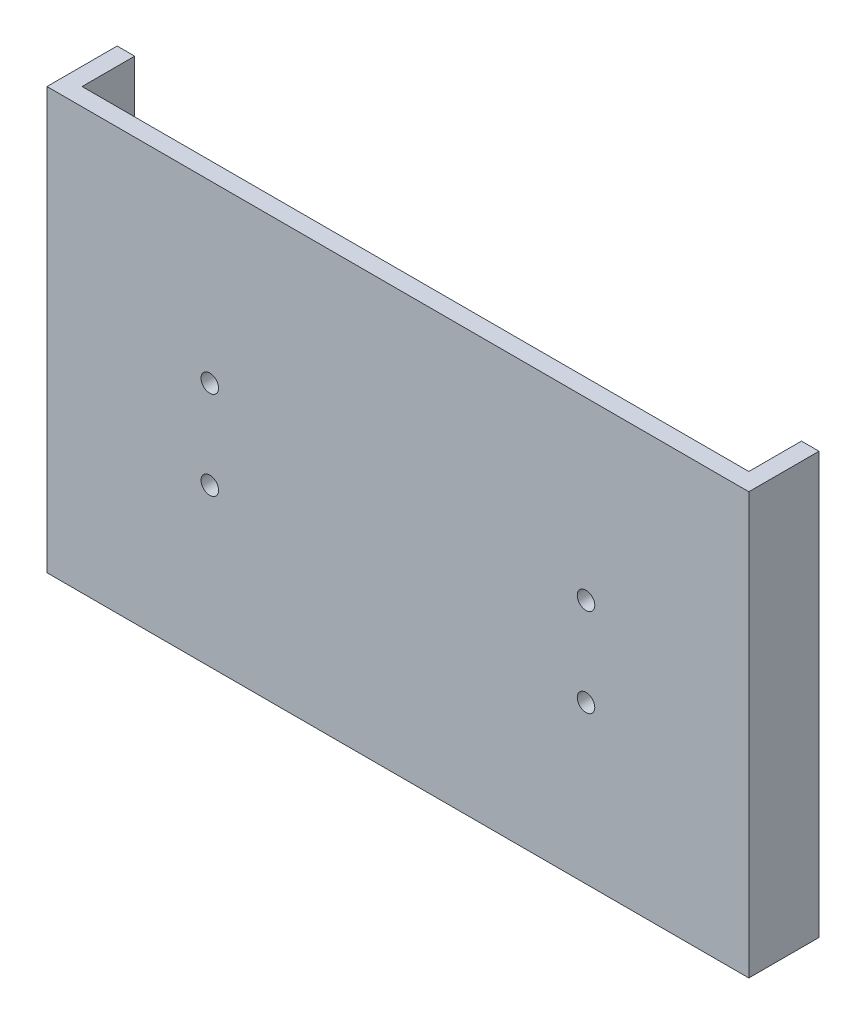
ISO-10303-21;
HEADER;
FILE_DESCRIPTION(('STEP AP214'),'2;1');
FILE_NAME('part.step','',(''),(''),'','','');
FILE_SCHEMA(('AUTOMOTIVE_DESIGN { 1 0 10303 214 1 1 1 1 }'));
ENDSEC;
DATA;
#1=APPLICATION_CONTEXT('core data for automotive mechanical design processes');
#2=APPLICATION_PROTOCOL_DEFINITION('international standard','automotive_design',2000,#1);
#3=PRODUCT_CONTEXT('',#1,'mechanical');
#4=PRODUCT('Part','Part','',(#3));
#5=PRODUCT_RELATED_PRODUCT_CATEGORY('part','',(#4));
#6=PRODUCT_DEFINITION_FORMATION('','',#4);
#7=PRODUCT_DEFINITION_CONTEXT('part definition',#1,'design');
#8=PRODUCT_DEFINITION('design','',#6,#7);
#9=PRODUCT_DEFINITION_SHAPE('','',#8);
#10=(LENGTH_UNIT() NAMED_UNIT(*) SI_UNIT(.MILLI.,.METRE.));
#11=(NAMED_UNIT(*) PLANE_ANGLE_UNIT() SI_UNIT($,.RADIAN.));
#12=(NAMED_UNIT(*) SI_UNIT($,.STERADIAN.) SOLID_ANGLE_UNIT());
#13=UNCERTAINTY_MEASURE_WITH_UNIT(LENGTH_MEASURE(1.E-05),#10,'distance_accuracy_value','');
#14=(GEOMETRIC_REPRESENTATION_CONTEXT(3) GLOBAL_UNCERTAINTY_ASSIGNED_CONTEXT((#13)) GLOBAL_UNIT_ASSIGNED_CONTEXT((#10,
#11,#12)) REPRESENTATION_CONTEXT('',''));
#15=CARTESIAN_POINT('',(0.,0.,0.));
#16=DIRECTION('',(0.,0.,1.));
#17=DIRECTION('',(1.,0.,0.));
#18=AXIS2_PLACEMENT_3D('',#15,#16,#17);
#19=CARTESIAN_POINT('',(127.,139.7,0.));
#20=DIRECTION('',(0.,0.,-1.));
#21=DIRECTION('',(-1.,0.,0.));
#22=AXIS2_PLACEMENT_3D('',#19,#20,#21);
#23=PLANE('',#22);
#24=CARTESIAN_POINT('',(97.536,91.948,0.));
#25=DIRECTION('',(0.,0.,-1.));
#26=DIRECTION('',(-1.,0.,0.));
#27=AXIS2_PLACEMENT_3D('',#24,#25,#26);
#28=CIRCLE('',#27,1.58749999999999);
#29=CARTESIAN_POINT('',(95.9485,91.948,0.));
#30=VERTEX_POINT('',#29);
#31=EDGE_CURVE('E179',#30,#30,#28,.T.);
#32=ORIENTED_EDGE('',*,*,#31,.T.);
#33=EDGE_LOOP('',(#32));
#34=FACE_BOUND('',#33,.T.);
#35=CARTESIAN_POINT('',(29.464,91.948,0.));
#36=DIRECTION('',(0.,0.,-1.));
#37=DIRECTION('',(-1.,0.,0.));
#38=AXIS2_PLACEMENT_3D('',#35,#36,#37);
#39=CIRCLE('',#38,1.5875);
#40=CARTESIAN_POINT('',(27.8765,91.948,0.));
#41=VERTEX_POINT('',#40);
#42=EDGE_CURVE('E182',#41,#41,#39,.T.);
#43=ORIENTED_EDGE('',*,*,#42,.T.);
#44=EDGE_LOOP('',(#43));
#45=FACE_BOUND('',#44,.T.);
#46=CARTESIAN_POINT('',(29.464,107.95,0.));
#47=DIRECTION('',(0.,0.,-1.));
#48=DIRECTION('',(-1.,0.,0.));
#49=AXIS2_PLACEMENT_3D('',#46,#47,#48);
#50=CIRCLE('',#49,1.5875);
#51=CARTESIAN_POINT('',(27.8765,107.95,0.));
#52=VERTEX_POINT('',#51);
#53=EDGE_CURVE('E185',#52,#52,#50,.T.);
#54=ORIENTED_EDGE('',*,*,#53,.T.);
#55=EDGE_LOOP('',(#54));
#56=FACE_BOUND('',#55,.T.);
#57=CARTESIAN_POINT('',(97.536,107.95,0.));
#58=DIRECTION('',(0.,0.,-1.));
#59=DIRECTION('',(-1.,0.,0.));
#60=AXIS2_PLACEMENT_3D('',#57,#58,#59);
#61=CIRCLE('',#60,1.58749999999999);
#62=CARTESIAN_POINT('',(95.9485,107.95,0.));
#63=VERTEX_POINT('',#62);
#64=EDGE_CURVE('E188',#63,#63,#61,.T.);
#65=ORIENTED_EDGE('',*,*,#64,.T.);
#66=EDGE_LOOP('',(#65));
#67=FACE_BOUND('',#66,.T.);
#68=DIRECTION('',(-1.,0.,0.));
#69=VECTOR('',#68,1.);
#70=CARTESIAN_POINT('',(0.,63.5,0.));
#71=LINE('',#70,#69);
#72=CARTESIAN_POINT('',(127.,63.5,0.));
#73=VERTEX_POINT('',#72);
#74=CARTESIAN_POINT('',(0.,63.5,0.));
#75=VERTEX_POINT('',#74);
#76=EDGE_CURVE('E48',#73,#75,#71,.T.);
#77=ORIENTED_EDGE('',*,*,#76,.F.);
#78=DIRECTION('',(0.,-1.,0.));
#79=VECTOR('',#78,1.);
#80=CARTESIAN_POINT('',(127.,139.7,0.));
#81=LINE('',#80,#79);
#82=CARTESIAN_POINT('',(127.,139.7,0.));
#83=VERTEX_POINT('',#82);
#84=EDGE_CURVE('E11',#83,#73,#81,.T.);
#85=ORIENTED_EDGE('',*,*,#84,.F.);
#86=DIRECTION('',(1.,0.,0.));
#87=VECTOR('',#86,1.);
#88=CARTESIAN_POINT('',(127.,139.7,0.));
#89=LINE('',#88,#87);
#90=CARTESIAN_POINT('',(0.,139.7,0.));
#91=VERTEX_POINT('',#90);
#92=EDGE_CURVE('E134',#91,#83,#89,.T.);
#93=ORIENTED_EDGE('',*,*,#92,.F.);
#94=DIRECTION('',(0.,-1.,0.));
#95=VECTOR('',#94,1.);
#96=CARTESIAN_POINT('',(0.,139.7,0.));
#97=LINE('',#96,#95);
#98=EDGE_CURVE('E154',#91,#75,#97,.T.);
#99=ORIENTED_EDGE('',*,*,#98,.T.);
#100=EDGE_LOOP('',(#77,#85,#93,#99));
#101=FACE_BOUND('',#100,.T.);
#102=ADVANCED_FACE('F32',(#34,#45,#56,#67,#101),#23,.F.);
#103=CARTESIAN_POINT('',(127.,139.7,-12.7));
#104=DIRECTION('',(-1.,0.,0.));
#105=DIRECTION('',(0.,0.,1.));
#106=AXIS2_PLACEMENT_3D('',#103,#104,#105);
#107=PLANE('',#106);
#108=DIRECTION('',(0.,0.,-1.));
#109=VECTOR('',#108,1.);
#110=CARTESIAN_POINT('',(127.,63.5,0.));
#111=LINE('',#110,#109);
#112=CARTESIAN_POINT('',(127.,63.5,-12.7));
#113=VERTEX_POINT('',#112);
#114=EDGE_CURVE('E100',#73,#113,#111,.T.);
#115=ORIENTED_EDGE('',*,*,#114,.T.);
#116=DIRECTION('',(0.,-1.,0.));
#117=VECTOR('',#116,1.);
#118=CARTESIAN_POINT('',(127.,139.7,-12.7));
#119=LINE('',#118,#117);
#120=CARTESIAN_POINT('',(127.,139.7,-12.7));
#121=VERTEX_POINT('',#120);
#122=EDGE_CURVE('E40',#121,#113,#119,.T.);
#123=ORIENTED_EDGE('',*,*,#122,.F.);
#124=DIRECTION('',(0.,0.,-1.));
#125=VECTOR('',#124,1.);
#126=CARTESIAN_POINT('',(127.,139.7,-12.7));
#127=LINE('',#126,#125);
#128=EDGE_CURVE('E137',#83,#121,#127,.T.);
#129=ORIENTED_EDGE('',*,*,#128,.F.);
#130=ORIENTED_EDGE('',*,*,#84,.T.);
#131=EDGE_LOOP('',(#115,#123,#129,#130));
#132=FACE_BOUND('',#131,.T.);
#133=ADVANCED_FACE('F111',(#132),#107,.F.);
#134=CARTESIAN_POINT('',(123.825,139.7,-12.7));
#135=DIRECTION('',(0.,0.,1.));
#136=DIRECTION('',(1.,0.,0.));
#137=AXIS2_PLACEMENT_3D('',#134,#135,#136);
#138=PLANE('',#137);
#139=DIRECTION('',(-1.,0.,0.));
#140=VECTOR('',#139,1.);
#141=CARTESIAN_POINT('',(0.,63.5,-12.7));
#142=LINE('',#141,#140);
#143=CARTESIAN_POINT('',(123.825,63.5,-12.7));
#144=VERTEX_POINT('',#143);
#145=EDGE_CURVE('E97',#113,#144,#142,.T.);
#146=ORIENTED_EDGE('',*,*,#145,.T.);
#147=DIRECTION('',(0.,-1.,0.));
#148=VECTOR('',#147,1.);
#149=CARTESIAN_POINT('',(123.825,139.7,-12.7));
#150=LINE('',#149,#148);
#151=CARTESIAN_POINT('',(123.825,139.7,-12.7));
#152=VERTEX_POINT('',#151);
#153=EDGE_CURVE('E118',#152,#144,#150,.T.);
#154=ORIENTED_EDGE('',*,*,#153,.F.);
#155=DIRECTION('',(-1.,0.,0.));
#156=VECTOR('',#155,1.);
#157=CARTESIAN_POINT('',(123.825,139.7,-12.7));
#158=LINE('',#157,#156);
#159=EDGE_CURVE('E117',#121,#152,#158,.T.);
#160=ORIENTED_EDGE('',*,*,#159,.F.);
#161=ORIENTED_EDGE('',*,*,#122,.T.);
#162=EDGE_LOOP('',(#146,#154,#160,#161));
#163=FACE_BOUND('',#162,.T.);
#164=ADVANCED_FACE('F116',(#163),#138,.F.);
#165=CARTESIAN_POINT('',(123.825,139.7,-3.175));
#166=DIRECTION('',(1.,0.,0.));
#167=DIRECTION('',(0.,0.,-1.));
#168=AXIS2_PLACEMENT_3D('',#165,#166,#167);
#169=PLANE('',#168);
#170=DIRECTION('',(0.,0.,-1.));
#171=VECTOR('',#170,1.);
#172=CARTESIAN_POINT('',(123.825,63.5,-3.175));
#173=LINE('',#172,#171);
#174=CARTESIAN_POINT('',(123.825,63.5,-3.175));
#175=VERTEX_POINT('',#174);
#176=EDGE_CURVE('E102',#175,#144,#173,.T.);
#177=ORIENTED_EDGE('',*,*,#176,.F.);
#178=DIRECTION('',(0.,-1.,0.));
#179=VECTOR('',#178,1.);
#180=CARTESIAN_POINT('',(123.825,139.7,-3.175));
#181=LINE('',#180,#179);
#182=CARTESIAN_POINT('',(123.825,139.7,-3.175));
#183=VERTEX_POINT('',#182);
#184=EDGE_CURVE('E120',#183,#175,#181,.T.);
#185=ORIENTED_EDGE('',*,*,#184,.F.);
#186=DIRECTION('',(0.,0.,1.));
#187=VECTOR('',#186,1.);
#188=CARTESIAN_POINT('',(123.825,139.7,-3.175));
#189=LINE('',#188,#187);
#190=EDGE_CURVE('E145',#152,#183,#189,.T.);
#191=ORIENTED_EDGE('',*,*,#190,.F.);
#192=ORIENTED_EDGE('',*,*,#153,.T.);
#193=EDGE_LOOP('',(#177,#185,#191,#192));
#194=FACE_BOUND('',#193,.T.);
#195=ADVANCED_FACE('F175',(#194),#169,.F.);
#196=CARTESIAN_POINT('',(3.175,139.7,-3.175));
#197=DIRECTION('',(0.,0.,1.));
#198=DIRECTION('',(1.,0.,0.));
#199=AXIS2_PLACEMENT_3D('',#196,#197,#198);
#200=PLANE('',#199);
#201=CARTESIAN_POINT('',(97.536,91.948,-3.175));
#202=DIRECTION('',(0.,0.,1.));
#203=DIRECTION('',(1.,0.,0.));
#204=AXIS2_PLACEMENT_3D('',#201,#202,#203);
#205=CIRCLE('',#204,1.58749999999999);
#206=CARTESIAN_POINT('',(99.1235,91.948,-3.175));
#207=VERTEX_POINT('',#206);
#208=EDGE_CURVE('E124',#207,#207,#205,.T.);
#209=ORIENTED_EDGE('',*,*,#208,.T.);
#210=EDGE_LOOP('',(#209));
#211=FACE_BOUND('',#210,.T.);
#212=CARTESIAN_POINT('',(29.464,91.948,-3.175));
#213=DIRECTION('',(0.,0.,1.));
#214=DIRECTION('',(1.,0.,0.));
#215=AXIS2_PLACEMENT_3D('',#212,#213,#214);
#216=CIRCLE('',#215,1.5875);
#217=CARTESIAN_POINT('',(31.0515,91.948,-3.175));
#218=VERTEX_POINT('',#217);
#219=EDGE_CURVE('E127',#218,#218,#216,.T.);
#220=ORIENTED_EDGE('',*,*,#219,.T.);
#221=EDGE_LOOP('',(#220));
#222=FACE_BOUND('',#221,.T.);
#223=CARTESIAN_POINT('',(29.464,107.95,-3.175));
#224=DIRECTION('',(0.,0.,1.));
#225=DIRECTION('',(1.,0.,0.));
#226=AXIS2_PLACEMENT_3D('',#223,#224,#225);
#227=CIRCLE('',#226,1.5875);
#228=CARTESIAN_POINT('',(31.0515,107.95,-3.175));
#229=VERTEX_POINT('',#228);
#230=EDGE_CURVE('E129',#229,#229,#227,.T.);
#231=ORIENTED_EDGE('',*,*,#230,.T.);
#232=EDGE_LOOP('',(#231));
#233=FACE_BOUND('',#232,.T.);
#234=CARTESIAN_POINT('',(97.536,107.95,-3.175));
#235=DIRECTION('',(0.,0.,1.));
#236=DIRECTION('',(1.,0.,0.));
#237=AXIS2_PLACEMENT_3D('',#234,#235,#236);
#238=CIRCLE('',#237,1.58749999999999);
#239=CARTESIAN_POINT('',(99.1235,107.95,-3.175));
#240=VERTEX_POINT('',#239);
#241=EDGE_CURVE('E35',#240,#240,#238,.T.);
#242=ORIENTED_EDGE('',*,*,#241,.T.);
#243=EDGE_LOOP('',(#242));
#244=FACE_BOUND('',#243,.T.);
#245=DIRECTION('',(1.,0.,0.));
#246=VECTOR('',#245,1.);
#247=CARTESIAN_POINT('',(3.175,63.5,-3.175));
#248=LINE('',#247,#246);
#249=CARTESIAN_POINT('',(3.175,63.5,-3.175));
#250=VERTEX_POINT('',#249);
#251=EDGE_CURVE('E172',#250,#175,#248,.T.);
#252=ORIENTED_EDGE('',*,*,#251,.F.);
#253=DIRECTION('',(0.,-1.,0.));
#254=VECTOR('',#253,1.);
#255=CARTESIAN_POINT('',(3.175,139.7,-3.175));
#256=LINE('',#255,#254);
#257=CARTESIAN_POINT('',(3.175,139.7,-3.175));
#258=VERTEX_POINT('',#257);
#259=EDGE_CURVE('E163',#258,#250,#256,.T.);
#260=ORIENTED_EDGE('',*,*,#259,.F.);
#261=DIRECTION('',(-1.,0.,0.));
#262=VECTOR('',#261,1.);
#263=CARTESIAN_POINT('',(3.175,139.7,-3.175));
#264=LINE('',#263,#262);
#265=EDGE_CURVE('E147',#183,#258,#264,.T.);
#266=ORIENTED_EDGE('',*,*,#265,.F.);
#267=ORIENTED_EDGE('',*,*,#184,.T.);
#268=EDGE_LOOP('',(#252,#260,#266,#267));
#269=FACE_BOUND('',#268,.T.);
#270=ADVANCED_FACE('F170',(#211,#222,#233,#244,#269),#200,.F.);
#271=CARTESIAN_POINT('',(3.175,139.7,-12.7));
#272=DIRECTION('',(-1.,0.,0.));
#273=DIRECTION('',(0.,0.,1.));
#274=AXIS2_PLACEMENT_3D('',#271,#272,#273);
#275=PLANE('',#274);
#276=DIRECTION('',(0.,0.,1.));
#277=VECTOR('',#276,1.);
#278=CARTESIAN_POINT('',(3.175,63.5,-12.7));
#279=LINE('',#278,#277);
#280=CARTESIAN_POINT('',(3.175,63.5,-12.7));
#281=VERTEX_POINT('',#280);
#282=EDGE_CURVE('E176',#281,#250,#279,.T.);
#283=ORIENTED_EDGE('',*,*,#282,.F.);
#284=DIRECTION('',(0.,-1.,0.));
#285=VECTOR('',#284,1.);
#286=CARTESIAN_POINT('',(3.175,139.7,-12.7));
#287=LINE('',#286,#285);
#288=CARTESIAN_POINT('',(3.175,139.7,-12.7));
#289=VERTEX_POINT('',#288);
#290=EDGE_CURVE('E160',#289,#281,#287,.T.);
#291=ORIENTED_EDGE('',*,*,#290,.F.);
#292=DIRECTION('',(0.,0.,-1.));
#293=VECTOR('',#292,1.);
#294=CARTESIAN_POINT('',(3.175,139.7,-12.7));
#295=LINE('',#294,#293);
#296=EDGE_CURVE('E149',#258,#289,#295,.T.);
#297=ORIENTED_EDGE('',*,*,#296,.F.);
#298=ORIENTED_EDGE('',*,*,#259,.T.);
#299=EDGE_LOOP('',(#283,#291,#297,#298));
#300=FACE_BOUND('',#299,.T.);
#301=ADVANCED_FACE('F242',(#300),#275,.F.);
#302=CARTESIAN_POINT('',(0.,139.7,-12.7));
#303=DIRECTION('',(0.,0.,1.));
#304=DIRECTION('',(1.,0.,0.));
#305=AXIS2_PLACEMENT_3D('',#302,#303,#304);
#306=PLANE('',#305);
#307=CARTESIAN_POINT('',(0.,63.5,-12.7));
#308=VERTEX_POINT('',#307);
#309=EDGE_CURVE('E107',#281,#308,#142,.T.);
#310=ORIENTED_EDGE('',*,*,#309,.T.);
#311=DIRECTION('',(0.,-1.,0.));
#312=VECTOR('',#311,1.);
#313=CARTESIAN_POINT('',(0.,139.7,-12.7));
#314=LINE('',#313,#312);
#315=CARTESIAN_POINT('',(0.,139.7,-12.7));
#316=VERTEX_POINT('',#315);
#317=EDGE_CURVE('E157',#316,#308,#314,.T.);
#318=ORIENTED_EDGE('',*,*,#317,.F.);
#319=DIRECTION('',(-1.,0.,0.));
#320=VECTOR('',#319,1.);
#321=CARTESIAN_POINT('',(0.,139.7,-12.7));
#322=LINE('',#321,#320);
#323=EDGE_CURVE('E151',#289,#316,#322,.T.);
#324=ORIENTED_EDGE('',*,*,#323,.F.);
#325=ORIENTED_EDGE('',*,*,#290,.T.);
#326=EDGE_LOOP('',(#310,#318,#324,#325));
#327=FACE_BOUND('',#326,.T.);
#328=ADVANCED_FACE('F197',(#327),#306,.F.);
#329=CARTESIAN_POINT('',(0.,139.7,0.));
#330=DIRECTION('',(1.,0.,0.));
#331=DIRECTION('',(0.,0.,-1.));
#332=AXIS2_PLACEMENT_3D('',#329,#330,#331);
#333=PLANE('',#332);
#334=DIRECTION('',(0.,0.,-1.));
#335=VECTOR('',#334,1.);
#336=CARTESIAN_POINT('',(0.,63.5,0.));
#337=LINE('',#336,#335);
#338=EDGE_CURVE('E114',#75,#308,#337,.T.);
#339=ORIENTED_EDGE('',*,*,#338,.F.);
#340=ORIENTED_EDGE('',*,*,#98,.F.);
#341=DIRECTION('',(0.,0.,1.));
#342=VECTOR('',#341,1.);
#343=CARTESIAN_POINT('',(0.,139.7,0.));
#344=LINE('',#343,#342);
#345=EDGE_CURVE('E56',#316,#91,#344,.T.);
#346=ORIENTED_EDGE('',*,*,#345,.F.);
#347=ORIENTED_EDGE('',*,*,#317,.T.);
#348=EDGE_LOOP('',(#339,#340,#346,#347));
#349=FACE_BOUND('',#348,.T.);
#350=ADVANCED_FACE('F200',(#349),#333,.F.);
#351=CARTESIAN_POINT('',(0.,139.7,0.));
#352=DIRECTION('',(0.,-1.,0.));
#353=DIRECTION('',(0.,0.,-1.));
#354=AXIS2_PLACEMENT_3D('',#351,#352,#353);
#355=PLANE('',#354);
#356=ORIENTED_EDGE('',*,*,#92,.T.);
#357=ORIENTED_EDGE('',*,*,#128,.T.);
#358=ORIENTED_EDGE('',*,*,#159,.T.);
#359=ORIENTED_EDGE('',*,*,#190,.T.);
#360=ORIENTED_EDGE('',*,*,#265,.T.);
#361=ORIENTED_EDGE('',*,*,#296,.T.);
#362=ORIENTED_EDGE('',*,*,#323,.T.);
#363=ORIENTED_EDGE('',*,*,#345,.T.);
#364=EDGE_LOOP('',(#356,#357,#358,#359,#360,#361,#362,#363));
#365=FACE_BOUND('',#364,.T.);
#366=ADVANCED_FACE('F235',(#365),#355,.F.);
#367=CARTESIAN_POINT('',(0.,63.5,0.));
#368=DIRECTION('',(0.,-1.,0.));
#369=DIRECTION('',(0.,0.,-1.));
#370=AXIS2_PLACEMENT_3D('',#367,#368,#369);
#371=PLANE('',#370);
#372=ORIENTED_EDGE('',*,*,#176,.T.);
#373=ORIENTED_EDGE('',*,*,#145,.F.);
#374=ORIENTED_EDGE('',*,*,#114,.F.);
#375=ORIENTED_EDGE('',*,*,#76,.T.);
#376=ORIENTED_EDGE('',*,*,#338,.T.);
#377=ORIENTED_EDGE('',*,*,#309,.F.);
#378=ORIENTED_EDGE('',*,*,#282,.T.);
#379=ORIENTED_EDGE('',*,*,#251,.T.);
#380=EDGE_LOOP('',(#372,#373,#374,#375,#376,#377,#378,#379));
#381=FACE_BOUND('',#380,.T.);
#382=ADVANCED_FACE('F99',(#381),#371,.T.);
#383=CARTESIAN_POINT('',(97.536,91.948,0.));
#384=DIRECTION('',(0.,0.,-1.));
#385=DIRECTION('',(-1.,0.,0.));
#386=AXIS2_PLACEMENT_3D('',#383,#384,#385);
#387=CYLINDRICAL_SURFACE('',#386,1.58749999999999);
#388=ORIENTED_EDGE('',*,*,#31,.F.);
#389=EDGE_LOOP('',(#388));
#390=FACE_BOUND('',#389,.T.);
#391=ORIENTED_EDGE('',*,*,#208,.F.);
#392=EDGE_LOOP('',(#391));
#393=FACE_BOUND('',#392,.T.);
#394=ADVANCED_FACE('F230',(#390,#393),#387,.F.);
#395=CARTESIAN_POINT('',(29.464,91.948,0.));
#396=DIRECTION('',(0.,0.,-1.));
#397=DIRECTION('',(-1.,0.,0.));
#398=AXIS2_PLACEMENT_3D('',#395,#396,#397);
#399=CYLINDRICAL_SURFACE('',#398,1.5875);
#400=ORIENTED_EDGE('',*,*,#42,.F.);
#401=EDGE_LOOP('',(#400));
#402=FACE_BOUND('',#401,.T.);
#403=ORIENTED_EDGE('',*,*,#219,.F.);
#404=EDGE_LOOP('',(#403));
#405=FACE_BOUND('',#404,.T.);
#406=ADVANCED_FACE('F223',(#402,#405),#399,.F.);
#407=CARTESIAN_POINT('',(29.464,107.95,0.));
#408=DIRECTION('',(0.,0.,-1.));
#409=DIRECTION('',(-1.,0.,0.));
#410=AXIS2_PLACEMENT_3D('',#407,#408,#409);
#411=CYLINDRICAL_SURFACE('',#410,1.5875);
#412=ORIENTED_EDGE('',*,*,#53,.F.);
#413=EDGE_LOOP('',(#412));
#414=FACE_BOUND('',#413,.T.);
#415=ORIENTED_EDGE('',*,*,#230,.F.);
#416=EDGE_LOOP('',(#415));
#417=FACE_BOUND('',#416,.T.);
#418=ADVANCED_FACE('F218',(#414,#417),#411,.F.);
#419=CARTESIAN_POINT('',(97.536,107.95,0.));
#420=DIRECTION('',(0.,0.,-1.));
#421=DIRECTION('',(-1.,0.,0.));
#422=AXIS2_PLACEMENT_3D('',#419,#420,#421);
#423=CYLINDRICAL_SURFACE('',#422,1.58749999999999);
#424=ORIENTED_EDGE('',*,*,#64,.F.);
#425=EDGE_LOOP('',(#424));
#426=FACE_BOUND('',#425,.T.);
#427=ORIENTED_EDGE('',*,*,#241,.F.);
#428=EDGE_LOOP('',(#427));
#429=FACE_BOUND('',#428,.T.);
#430=ADVANCED_FACE('F215',(#426,#429),#423,.F.);
#431=CLOSED_SHELL('',(#102,#133,#164,#195,#270,#301,#328,#350,#366,#382,#394,#406,#418,#430));
#432=MANIFOLD_SOLID_BREP('B2',#431);
#433=ADVANCED_BREP_SHAPE_REPRESENTATION('',(#18,#432),#14);
#434=SHAPE_DEFINITION_REPRESENTATION(#9,#433);
ENDSEC;
END-ISO-10303-21;
